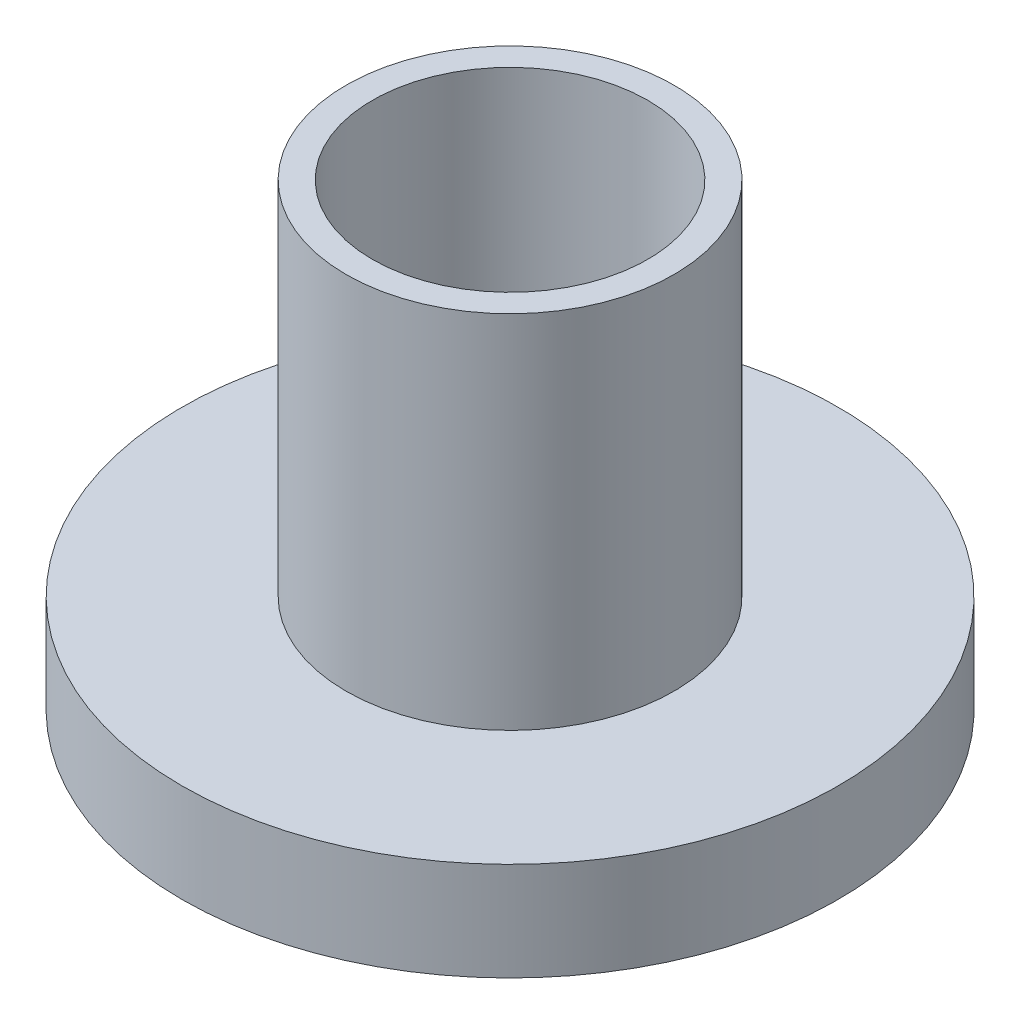
ISO-10303-21;
HEADER;
FILE_DESCRIPTION(('STEP AP214'),'2;1');
FILE_NAME('part.step','',(''),(''),'','','');
FILE_SCHEMA(('AUTOMOTIVE_DESIGN { 1 0 10303 214 1 1 1 1 }'));
ENDSEC;
DATA;
#1=APPLICATION_CONTEXT('core data for automotive mechanical design processes');
#2=APPLICATION_PROTOCOL_DEFINITION('international standard','automotive_design',2000,#1);
#3=PRODUCT_CONTEXT('',#1,'mechanical');
#4=PRODUCT('Part','Part','',(#3));
#5=PRODUCT_RELATED_PRODUCT_CATEGORY('part','',(#4));
#6=PRODUCT_DEFINITION_FORMATION('','',#4);
#7=PRODUCT_DEFINITION_CONTEXT('part definition',#1,'design');
#8=PRODUCT_DEFINITION('design','',#6,#7);
#9=PRODUCT_DEFINITION_SHAPE('','',#8);
#10=(LENGTH_UNIT() NAMED_UNIT(*) SI_UNIT(.MILLI.,.METRE.));
#11=(NAMED_UNIT(*) PLANE_ANGLE_UNIT() SI_UNIT($,.RADIAN.));
#12=(NAMED_UNIT(*) SI_UNIT($,.STERADIAN.) SOLID_ANGLE_UNIT());
#13=UNCERTAINTY_MEASURE_WITH_UNIT(LENGTH_MEASURE(1.E-05),#10,'distance_accuracy_value','');
#14=(GEOMETRIC_REPRESENTATION_CONTEXT(3) GLOBAL_UNCERTAINTY_ASSIGNED_CONTEXT((#13)) GLOBAL_UNIT_ASSIGNED_CONTEXT((#10,
#11,#12)) REPRESENTATION_CONTEXT('',''));
#15=CARTESIAN_POINT('',(0.,0.,0.));
#16=DIRECTION('',(0.,0.,1.));
#17=DIRECTION('',(1.,0.,0.));
#18=AXIS2_PLACEMENT_3D('',#15,#16,#17);
#19=CARTESIAN_POINT('',(0.,5.5,0.));
#20=DIRECTION('',(0.,-1.,0.));
#21=DIRECTION('',(0.,0.,-1.));
#22=AXIS2_PLACEMENT_3D('',#19,#20,#21);
#23=CYLINDRICAL_SURFACE('',#22,2.1);
#24=CARTESIAN_POINT('',(0.,5.5,0.));
#25=DIRECTION('',(0.,1.,0.));
#26=DIRECTION('',(0.,0.,1.));
#27=AXIS2_PLACEMENT_3D('',#24,#25,#26);
#28=CIRCLE('',#27,2.1);
#29=CARTESIAN_POINT('',(0.,5.5,2.1));
#30=VERTEX_POINT('',#29);
#31=EDGE_CURVE('E44',#30,#30,#28,.T.);
#32=ORIENTED_EDGE('',*,*,#31,.T.);
#33=EDGE_LOOP('',(#32));
#34=FACE_BOUND('',#33,.T.);
#35=CARTESIAN_POINT('',(0.,-1.5,0.));
#36=DIRECTION('',(0.,1.,0.));
#37=DIRECTION('',(0.,0.,1.));
#38=AXIS2_PLACEMENT_3D('',#35,#36,#37);
#39=CIRCLE('',#38,2.1);
#40=CARTESIAN_POINT('',(0.,-1.5,2.1));
#41=VERTEX_POINT('',#40);
#42=EDGE_CURVE('E54',#41,#41,#39,.T.);
#43=ORIENTED_EDGE('',*,*,#42,.F.);
#44=EDGE_LOOP('',(#43));
#45=FACE_BOUND('',#44,.T.);
#46=ADVANCED_FACE('F37',(#34,#45),#23,.F.);
#47=CARTESIAN_POINT('',(0.,5.5,0.));
#48=DIRECTION('',(0.,-1.,0.));
#49=DIRECTION('',(0.,0.,-1.));
#50=AXIS2_PLACEMENT_3D('',#47,#48,#49);
#51=CYLINDRICAL_SURFACE('',#50,2.5);
#52=CARTESIAN_POINT('',(0.,5.5,0.));
#53=DIRECTION('',(0.,1.,0.));
#54=DIRECTION('',(0.,0.,1.));
#55=AXIS2_PLACEMENT_3D('',#52,#53,#54);
#56=CIRCLE('',#55,2.5);
#57=CARTESIAN_POINT('',(0.,5.5,2.5));
#58=VERTEX_POINT('',#57);
#59=EDGE_CURVE('E10',#58,#58,#56,.T.);
#60=ORIENTED_EDGE('',*,*,#59,.F.);
#61=EDGE_LOOP('',(#60));
#62=FACE_BOUND('',#61,.T.);
#63=CARTESIAN_POINT('',(0.,0.,0.));
#64=DIRECTION('',(0.,1.,0.));
#65=DIRECTION('',(0.,0.,1.));
#66=AXIS2_PLACEMENT_3D('',#63,#64,#65);
#67=CIRCLE('',#66,2.5);
#68=CARTESIAN_POINT('',(0.,0.,2.5));
#69=VERTEX_POINT('',#68);
#70=EDGE_CURVE('E40',#69,#69,#67,.T.);
#71=ORIENTED_EDGE('',*,*,#70,.T.);
#72=EDGE_LOOP('',(#71));
#73=FACE_BOUND('',#72,.T.);
#74=ADVANCED_FACE('F71',(#62,#73),#51,.T.);
#75=CARTESIAN_POINT('',(0.,5.5,0.));
#76=DIRECTION('',(0.,1.,0.));
#77=DIRECTION('',(0.,0.,1.));
#78=AXIS2_PLACEMENT_3D('',#75,#76,#77);
#79=PLANE('',#78);
#80=ORIENTED_EDGE('',*,*,#31,.F.);
#81=EDGE_LOOP('',(#80));
#82=FACE_BOUND('',#81,.T.);
#83=ORIENTED_EDGE('',*,*,#59,.T.);
#84=EDGE_LOOP('',(#83));
#85=FACE_BOUND('',#84,.T.);
#86=ADVANCED_FACE('F76',(#82,#85),#79,.T.);
#87=CARTESIAN_POINT('',(0.,-1.5,0.));
#88=DIRECTION('',(0.,1.,0.));
#89=DIRECTION('',(0.,0.,1.));
#90=AXIS2_PLACEMENT_3D('',#87,#88,#89);
#91=CYLINDRICAL_SURFACE('',#90,5.);
#92=CARTESIAN_POINT('',(0.,-1.5,0.));
#93=DIRECTION('',(0.,1.,0.));
#94=DIRECTION('',(0.,0.,1.));
#95=AXIS2_PLACEMENT_3D('',#92,#93,#94);
#96=CIRCLE('',#95,5.);
#97=CARTESIAN_POINT('',(0.,-1.5,5.));
#98=VERTEX_POINT('',#97);
#99=EDGE_CURVE('E53',#98,#98,#96,.T.);
#100=ORIENTED_EDGE('',*,*,#99,.T.);
#101=EDGE_LOOP('',(#100));
#102=FACE_BOUND('',#101,.T.);
#103=CARTESIAN_POINT('',(0.,0.,0.));
#104=DIRECTION('',(0.,1.,0.));
#105=DIRECTION('',(0.,0.,1.));
#106=AXIS2_PLACEMENT_3D('',#103,#104,#105);
#107=CIRCLE('',#106,5.);
#108=CARTESIAN_POINT('',(0.,0.,5.));
#109=VERTEX_POINT('',#108);
#110=EDGE_CURVE('E50',#109,#109,#107,.T.);
#111=ORIENTED_EDGE('',*,*,#110,.F.);
#112=EDGE_LOOP('',(#111));
#113=FACE_BOUND('',#112,.T.);
#114=ADVANCED_FACE('F60',(#102,#113),#91,.T.);
#115=CARTESIAN_POINT('',(0.,-1.5,0.));
#116=DIRECTION('',(0.,1.,0.));
#117=DIRECTION('',(0.,0.,1.));
#118=AXIS2_PLACEMENT_3D('',#115,#116,#117);
#119=PLANE('',#118);
#120=ORIENTED_EDGE('',*,*,#99,.F.);
#121=EDGE_LOOP('',(#120));
#122=FACE_BOUND('',#121,.T.);
#123=ORIENTED_EDGE('',*,*,#42,.T.);
#124=EDGE_LOOP('',(#123));
#125=FACE_BOUND('',#124,.T.);
#126=ADVANCED_FACE('F63',(#122,#125),#119,.F.);
#127=CARTESIAN_POINT('',(0.,0.,0.));
#128=DIRECTION('',(0.,1.,0.));
#129=DIRECTION('',(0.,0.,1.));
#130=AXIS2_PLACEMENT_3D('',#127,#128,#129);
#131=PLANE('',#130);
#132=ORIENTED_EDGE('',*,*,#70,.F.);
#133=EDGE_LOOP('',(#132));
#134=FACE_BOUND('',#133,.T.);
#135=ORIENTED_EDGE('',*,*,#110,.T.);
#136=EDGE_LOOP('',(#135));
#137=FACE_BOUND('',#136,.T.);
#138=ADVANCED_FACE('F66',(#134,#137),#131,.T.);
#139=CLOSED_SHELL('',(#46,#74,#86,#114,#126,#138));
#140=MANIFOLD_SOLID_BREP('B2',#139);
#141=ADVANCED_BREP_SHAPE_REPRESENTATION('',(#18,#140),#14);
#142=SHAPE_DEFINITION_REPRESENTATION(#9,#141);
ENDSEC;
END-ISO-10303-21;
